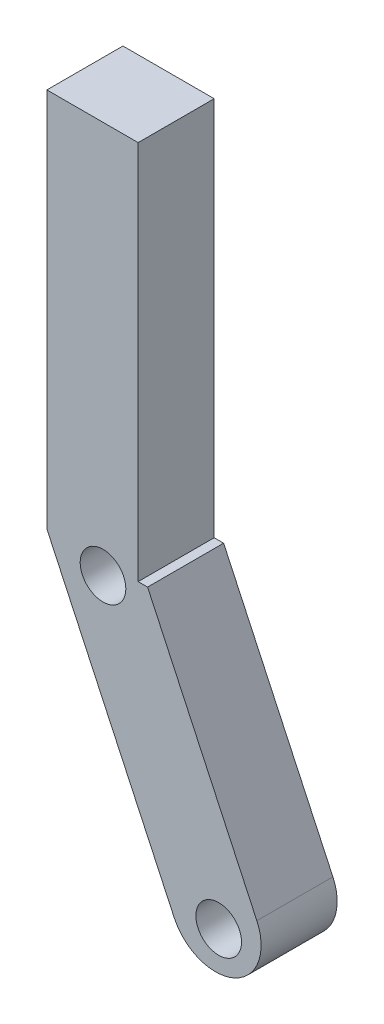
ISO-10303-21;
HEADER;
FILE_DESCRIPTION(('STEP AP214'),'2;1');
FILE_NAME('part.step','',(''),(''),'','','');
FILE_SCHEMA(('AUTOMOTIVE_DESIGN { 1 0 10303 214 1 1 1 1 }'));
ENDSEC;
DATA;
#1=APPLICATION_CONTEXT('core data for automotive mechanical design processes');
#2=APPLICATION_PROTOCOL_DEFINITION('international standard','automotive_design',2000,#1);
#3=PRODUCT_CONTEXT('',#1,'mechanical');
#4=PRODUCT('Part','Part','',(#3));
#5=PRODUCT_RELATED_PRODUCT_CATEGORY('part','',(#4));
#6=PRODUCT_DEFINITION_FORMATION('','',#4);
#7=PRODUCT_DEFINITION_CONTEXT('part definition',#1,'design');
#8=PRODUCT_DEFINITION('design','',#6,#7);
#9=PRODUCT_DEFINITION_SHAPE('','',#8);
#10=(LENGTH_UNIT() NAMED_UNIT(*) SI_UNIT(.MILLI.,.METRE.));
#11=(NAMED_UNIT(*) PLANE_ANGLE_UNIT() SI_UNIT($,.RADIAN.));
#12=(NAMED_UNIT(*) SI_UNIT($,.STERADIAN.) SOLID_ANGLE_UNIT());
#13=UNCERTAINTY_MEASURE_WITH_UNIT(LENGTH_MEASURE(1.E-05),#10,'distance_accuracy_value','');
#14=(GEOMETRIC_REPRESENTATION_CONTEXT(3) GLOBAL_UNCERTAINTY_ASSIGNED_CONTEXT((#13)) GLOBAL_UNIT_ASSIGNED_CONTEXT((#10,
#11,#12)) REPRESENTATION_CONTEXT('',''));
#15=CARTESIAN_POINT('',(0.,0.,0.));
#16=DIRECTION('',(0.,0.,1.));
#17=DIRECTION('',(1.,0.,0.));
#18=AXIS2_PLACEMENT_3D('',#15,#16,#17);
#19=CARTESIAN_POINT('',(11.0858546022568,-16.6750871648452,5.));
#20=DIRECTION('',(0.,0.,-1.));
#21=DIRECTION('',(-1.,0.,0.));
#22=AXIS2_PLACEMENT_3D('',#19,#20,#21);
#23=CYLINDRICAL_SURFACE('',#22,3.);
#24=DIRECTION('',(0.,0.,-1.));
#25=VECTOR('',#24,1.);
#26=CARTESIAN_POINT('',(13.8047779633667,-15.4072323796231,5.));
#27=LINE('',#26,#25);
#28=CARTESIAN_POINT('',(13.8047779633667,-15.4072323796231,5.));
#29=VERTEX_POINT('',#28);
#30=CARTESIAN_POINT('',(13.8047779633667,-15.4072323796231,0.));
#31=VERTEX_POINT('',#30);
#32=EDGE_CURVE('E110',#29,#31,#27,.T.);
#33=ORIENTED_EDGE('',*,*,#32,.F.);
#34=CARTESIAN_POINT('',(11.0858546022568,-16.6750871648452,5.));
#35=DIRECTION('',(0.,0.,1.));
#36=DIRECTION('',(1.,0.,0.));
#37=AXIS2_PLACEMENT_3D('',#34,#35,#36);
#38=CIRCLE('',#37,3.);
#39=CARTESIAN_POINT('',(8.36693124114681,-17.9429419500673,5.));
#40=VERTEX_POINT('',#39);
#41=EDGE_CURVE('E44',#40,#29,#38,.T.);
#42=ORIENTED_EDGE('',*,*,#41,.F.);
#43=DIRECTION('',(0.,0.,-1.));
#44=VECTOR('',#43,1.);
#45=CARTESIAN_POINT('',(8.36693124114681,-17.9429419500673,5.));
#46=LINE('',#45,#44);
#47=CARTESIAN_POINT('',(8.36693124114681,-17.9429419500673,0.));
#48=VERTEX_POINT('',#47);
#49=EDGE_CURVE('E149',#48,#40,#46,.F.);
#50=ORIENTED_EDGE('',*,*,#49,.F.);
#51=CARTESIAN_POINT('',(11.0858546022568,-16.6750871648452,0.));
#52=DIRECTION('',(0.,0.,1.));
#53=DIRECTION('',(1.,0.,0.));
#54=AXIS2_PLACEMENT_3D('',#51,#52,#53);
#55=CIRCLE('',#54,3.);
#56=EDGE_CURVE('E11',#31,#48,#55,.F.);
#57=ORIENTED_EDGE('',*,*,#56,.F.);
#58=EDGE_LOOP('',(#33,#42,#50,#57));
#59=FACE_BOUND('',#58,.T.);
#60=ADVANCED_FACE('F36',(#59),#23,.T.);
#61=CARTESIAN_POINT('',(0.,0.,5.));
#62=DIRECTION('',(0.,0.,1.));
#63=DIRECTION('',(1.,0.,0.));
#64=AXIS2_PLACEMENT_3D('',#61,#62,#63);
#65=PLANE('',#64);
#66=CARTESIAN_POINT('',(11.2971637331271,-17.1282410583635,5.));
#67=DIRECTION('',(0.,0.,1.));
#68=DIRECTION('',(1.,0.,0.));
#69=AXIS2_PLACEMENT_3D('',#66,#67,#68);
#70=CIRCLE('',#69,1.5);
#71=CARTESIAN_POINT('',(12.7971637331271,-17.1282410583635,5.));
#72=VERTEX_POINT('',#71);
#73=EDGE_CURVE('E129',#72,#72,#70,.T.);
#74=ORIENTED_EDGE('',*,*,#73,.F.);
#75=EDGE_LOOP('',(#74));
#76=FACE_BOUND('',#75,.T.);
#77=DIRECTION('',(0.422618261740694,-0.906307787036653,0.));
#78=VECTOR('',#77,1.);
#79=CARTESIAN_POINT('',(0.,0.,5.));
#80=LINE('',#79,#78);
#81=CARTESIAN_POINT('',(0.,0.,5.));
#82=VERTEX_POINT('',#81);
#83=EDGE_CURVE('E102',#82,#40,#80,.T.);
#84=ORIENTED_EDGE('',*,*,#83,.T.);
#85=ORIENTED_EDGE('',*,*,#41,.T.);
#86=DIRECTION('',(-0.422618261740694,0.906307787036652,0.));
#87=VECTOR('',#86,1.);
#88=CARTESIAN_POINT('',(15.0726327485888,-18.1261557407331,5.));
#89=LINE('',#88,#87);
#90=CARTESIAN_POINT('',(6.62026751377493,0.,5.));
#91=VERTEX_POINT('',#90);
#92=EDGE_CURVE('E92',#29,#91,#89,.T.);
#93=ORIENTED_EDGE('',*,*,#92,.T.);
#94=DIRECTION('',(-1.,0.,0.));
#95=VECTOR('',#94,1.);
#96=CARTESIAN_POINT('',(6.62026751377493,0.,5.));
#97=LINE('',#96,#95);
#98=CARTESIAN_POINT('',(6.,0.,5.));
#99=VERTEX_POINT('',#98);
#100=EDGE_CURVE('E98',#91,#99,#97,.T.);
#101=ORIENTED_EDGE('',*,*,#100,.T.);
#102=DIRECTION('',(0.,1.,0.));
#103=VECTOR('',#102,1.);
#104=CARTESIAN_POINT('',(6.,25.,5.));
#105=LINE('',#104,#103);
#106=CARTESIAN_POINT('',(6.,25.,5.));
#107=VERTEX_POINT('',#106);
#108=EDGE_CURVE('E116',#99,#107,#105,.T.);
#109=ORIENTED_EDGE('',*,*,#108,.T.);
#110=DIRECTION('',(-1.,0.,0.));
#111=VECTOR('',#110,1.);
#112=CARTESIAN_POINT('',(0.,25.,5.));
#113=LINE('',#112,#111);
#114=CARTESIAN_POINT('',(0.,25.,5.));
#115=VERTEX_POINT('',#114);
#116=EDGE_CURVE('E118',#107,#115,#113,.T.);
#117=ORIENTED_EDGE('',*,*,#116,.T.);
#118=DIRECTION('',(0.,-1.,0.));
#119=VECTOR('',#118,1.);
#120=CARTESIAN_POINT('',(0.,0.,5.));
#121=LINE('',#120,#119);
#122=EDGE_CURVE('E123',#115,#82,#121,.T.);
#123=ORIENTED_EDGE('',*,*,#122,.T.);
#124=EDGE_LOOP('',(#84,#85,#93,#101,#109,#117,#123));
#125=FACE_BOUND('',#124,.T.);
#126=CARTESIAN_POINT('',(3.69003502179463,-0.814700891703756,5.));
#127=DIRECTION('',(0.,0.,1.));
#128=DIRECTION('',(1.,0.,0.));
#129=AXIS2_PLACEMENT_3D('',#126,#127,#128);
#130=CIRCLE('',#129,1.5);
#131=CARTESIAN_POINT('',(5.19003502179463,-0.814700891703756,5.));
#132=VERTEX_POINT('',#131);
#133=EDGE_CURVE('E159',#132,#132,#130,.T.);
#134=ORIENTED_EDGE('',*,*,#133,.F.);
#135=EDGE_LOOP('',(#134));
#136=FACE_BOUND('',#135,.T.);
#137=ADVANCED_FACE('F95',(#76,#125,#136),#65,.T.);
#138=CARTESIAN_POINT('',(0.,0.,0.));
#139=DIRECTION('',(0.,0.,1.));
#140=DIRECTION('',(1.,0.,0.));
#141=AXIS2_PLACEMENT_3D('',#138,#139,#140);
#142=PLANE('',#141);
#143=DIRECTION('',(-0.422618261740694,0.906307787036652,0.));
#144=VECTOR('',#143,1.);
#145=CARTESIAN_POINT('',(15.0726327485888,-18.1261557407331,0.));
#146=LINE('',#145,#144);
#147=CARTESIAN_POINT('',(6.62026751377493,0.,0.));
#148=VERTEX_POINT('',#147);
#149=EDGE_CURVE('E107',#31,#148,#146,.T.);
#150=ORIENTED_EDGE('',*,*,#149,.F.);
#151=ORIENTED_EDGE('',*,*,#56,.T.);
#152=DIRECTION('',(0.422618261740694,-0.906307787036653,0.));
#153=VECTOR('',#152,1.);
#154=CARTESIAN_POINT('',(0.,0.,0.));
#155=LINE('',#154,#153);
#156=CARTESIAN_POINT('',(0.,0.,0.));
#157=VERTEX_POINT('',#156);
#158=EDGE_CURVE('E126',#157,#48,#155,.T.);
#159=ORIENTED_EDGE('',*,*,#158,.F.);
#160=DIRECTION('',(0.,-1.,0.));
#161=VECTOR('',#160,1.);
#162=CARTESIAN_POINT('',(0.,0.,0.));
#163=LINE('',#162,#161);
#164=CARTESIAN_POINT('',(0.,25.,0.));
#165=VERTEX_POINT('',#164);
#166=EDGE_CURVE('E137',#165,#157,#163,.T.);
#167=ORIENTED_EDGE('',*,*,#166,.F.);
#168=DIRECTION('',(-1.,0.,0.));
#169=VECTOR('',#168,1.);
#170=CARTESIAN_POINT('',(0.,25.,0.));
#171=LINE('',#170,#169);
#172=CARTESIAN_POINT('',(6.,25.,0.));
#173=VERTEX_POINT('',#172);
#174=EDGE_CURVE('E135',#173,#165,#171,.T.);
#175=ORIENTED_EDGE('',*,*,#174,.F.);
#176=DIRECTION('',(0.,1.,0.));
#177=VECTOR('',#176,1.);
#178=CARTESIAN_POINT('',(6.,25.,0.));
#179=LINE('',#178,#177);
#180=CARTESIAN_POINT('',(6.,0.,0.));
#181=VERTEX_POINT('',#180);
#182=EDGE_CURVE('E133',#181,#173,#179,.T.);
#183=ORIENTED_EDGE('',*,*,#182,.F.);
#184=DIRECTION('',(-1.,0.,0.));
#185=VECTOR('',#184,1.);
#186=CARTESIAN_POINT('',(6.62026751377493,0.,0.));
#187=LINE('',#186,#185);
#188=EDGE_CURVE('E131',#148,#181,#187,.T.);
#189=ORIENTED_EDGE('',*,*,#188,.F.);
#190=EDGE_LOOP('',(#150,#151,#159,#167,#175,#183,#189));
#191=FACE_BOUND('',#190,.T.);
#192=CARTESIAN_POINT('',(11.2971637331271,-17.1282410583635,0.));
#193=DIRECTION('',(0.,0.,1.));
#194=DIRECTION('',(1.,0.,0.));
#195=AXIS2_PLACEMENT_3D('',#192,#193,#194);
#196=CIRCLE('',#195,1.5);
#197=CARTESIAN_POINT('',(12.7971637331271,-17.1282410583635,0.));
#198=VERTEX_POINT('',#197);
#199=EDGE_CURVE('E156',#198,#198,#196,.T.);
#200=ORIENTED_EDGE('',*,*,#199,.T.);
#201=EDGE_LOOP('',(#200));
#202=FACE_BOUND('',#201,.T.);
#203=CARTESIAN_POINT('',(3.69003502179463,-0.814700891703756,0.));
#204=DIRECTION('',(0.,0.,1.));
#205=DIRECTION('',(1.,0.,0.));
#206=AXIS2_PLACEMENT_3D('',#203,#204,#205);
#207=CIRCLE('',#206,1.5);
#208=CARTESIAN_POINT('',(5.19003502179463,-0.814700891703756,0.));
#209=VERTEX_POINT('',#208);
#210=EDGE_CURVE('E162',#209,#209,#207,.T.);
#211=ORIENTED_EDGE('',*,*,#210,.T.);
#212=EDGE_LOOP('',(#211));
#213=FACE_BOUND('',#212,.T.);
#214=ADVANCED_FACE('F171',(#191,#202,#213),#142,.F.);
#215=CARTESIAN_POINT('',(0.,0.,5.));
#216=DIRECTION('',(0.906307787036653,0.422618261740694,0.));
#217=DIRECTION('',(-0.422618261740694,0.906307787036653,0.));
#218=AXIS2_PLACEMENT_3D('',#215,#216,#217);
#219=PLANE('',#218);
#220=ORIENTED_EDGE('',*,*,#158,.T.);
#221=ORIENTED_EDGE('',*,*,#49,.T.);
#222=ORIENTED_EDGE('',*,*,#83,.F.);
#223=DIRECTION('',(0.,0.,-1.));
#224=VECTOR('',#223,1.);
#225=CARTESIAN_POINT('',(0.,0.,5.));
#226=LINE('',#225,#224);
#227=EDGE_CURVE('E125',#82,#157,#226,.T.);
#228=ORIENTED_EDGE('',*,*,#227,.T.);
#229=EDGE_LOOP('',(#220,#221,#222,#228));
#230=FACE_BOUND('',#229,.T.);
#231=ADVANCED_FACE('F152',(#230),#219,.F.);
#232=CARTESIAN_POINT('',(15.0726327485888,-18.1261557407331,5.));
#233=DIRECTION('',(-0.906307787036653,-0.422618261740694,0.));
#234=DIRECTION('',(0.422618261740694,-0.906307787036653,0.));
#235=AXIS2_PLACEMENT_3D('',#232,#233,#234);
#236=PLANE('',#235);
#237=ORIENTED_EDGE('',*,*,#92,.F.);
#238=ORIENTED_EDGE('',*,*,#32,.T.);
#239=ORIENTED_EDGE('',*,*,#149,.T.);
#240=DIRECTION('',(0.,0.,-1.));
#241=VECTOR('',#240,1.);
#242=CARTESIAN_POINT('',(6.62026751377493,0.,5.));
#243=LINE('',#242,#241);
#244=EDGE_CURVE('E105',#91,#148,#243,.T.);
#245=ORIENTED_EDGE('',*,*,#244,.F.);
#246=EDGE_LOOP('',(#237,#238,#239,#245));
#247=FACE_BOUND('',#246,.T.);
#248=ADVANCED_FACE('F106',(#247),#236,.F.);
#249=CARTESIAN_POINT('',(6.62026751377493,0.,5.));
#250=DIRECTION('',(0.,-1.,0.));
#251=DIRECTION('',(1.,0.,0.));
#252=AXIS2_PLACEMENT_3D('',#249,#250,#251);
#253=PLANE('',#252);
#254=ORIENTED_EDGE('',*,*,#188,.T.);
#255=DIRECTION('',(0.,0.,-1.));
#256=VECTOR('',#255,1.);
#257=CARTESIAN_POINT('',(6.,0.,5.));
#258=LINE('',#257,#256);
#259=EDGE_CURVE('E111',#99,#181,#258,.T.);
#260=ORIENTED_EDGE('',*,*,#259,.F.);
#261=ORIENTED_EDGE('',*,*,#100,.F.);
#262=ORIENTED_EDGE('',*,*,#244,.T.);
#263=EDGE_LOOP('',(#254,#260,#261,#262));
#264=FACE_BOUND('',#263,.T.);
#265=ADVANCED_FACE('F113',(#264),#253,.F.);
#266=CARTESIAN_POINT('',(6.,25.,5.));
#267=DIRECTION('',(-1.,0.,0.));
#268=DIRECTION('',(0.,-1.,0.));
#269=AXIS2_PLACEMENT_3D('',#266,#267,#268);
#270=PLANE('',#269);
#271=ORIENTED_EDGE('',*,*,#182,.T.);
#272=DIRECTION('',(0.,0.,-1.));
#273=VECTOR('',#272,1.);
#274=CARTESIAN_POINT('',(6.,25.,5.));
#275=LINE('',#274,#273);
#276=EDGE_CURVE('E144',#107,#173,#275,.T.);
#277=ORIENTED_EDGE('',*,*,#276,.F.);
#278=ORIENTED_EDGE('',*,*,#108,.F.);
#279=ORIENTED_EDGE('',*,*,#259,.T.);
#280=EDGE_LOOP('',(#271,#277,#278,#279));
#281=FACE_BOUND('',#280,.T.);
#282=ADVANCED_FACE('F191',(#281),#270,.F.);
#283=CARTESIAN_POINT('',(0.,25.,5.));
#284=DIRECTION('',(0.,-1.,0.));
#285=DIRECTION('',(0.,0.,-1.));
#286=AXIS2_PLACEMENT_3D('',#283,#284,#285);
#287=PLANE('',#286);
#288=ORIENTED_EDGE('',*,*,#174,.T.);
#289=DIRECTION('',(0.,0.,-1.));
#290=VECTOR('',#289,1.);
#291=CARTESIAN_POINT('',(0.,25.,5.));
#292=LINE('',#291,#290);
#293=EDGE_CURVE('E141',#115,#165,#292,.T.);
#294=ORIENTED_EDGE('',*,*,#293,.F.);
#295=ORIENTED_EDGE('',*,*,#116,.F.);
#296=ORIENTED_EDGE('',*,*,#276,.T.);
#297=EDGE_LOOP('',(#288,#294,#295,#296));
#298=FACE_BOUND('',#297,.T.);
#299=ADVANCED_FACE('F187',(#298),#287,.F.);
#300=CARTESIAN_POINT('',(0.,0.,5.));
#301=DIRECTION('',(1.,0.,0.));
#302=DIRECTION('',(0.,0.,-1.));
#303=AXIS2_PLACEMENT_3D('',#300,#301,#302);
#304=PLANE('',#303);
#305=ORIENTED_EDGE('',*,*,#166,.T.);
#306=ORIENTED_EDGE('',*,*,#227,.F.);
#307=ORIENTED_EDGE('',*,*,#122,.F.);
#308=ORIENTED_EDGE('',*,*,#293,.T.);
#309=EDGE_LOOP('',(#305,#306,#307,#308));
#310=FACE_BOUND('',#309,.T.);
#311=ADVANCED_FACE('F184',(#310),#304,.F.);
#312=CARTESIAN_POINT('',(11.2971637331271,-17.1282410583635,5.));
#313=DIRECTION('',(0.,0.,-1.));
#314=DIRECTION('',(-1.,0.,0.));
#315=AXIS2_PLACEMENT_3D('',#312,#313,#314);
#316=CYLINDRICAL_SURFACE('',#315,1.5);
#317=ORIENTED_EDGE('',*,*,#73,.T.);
#318=EDGE_LOOP('',(#317));
#319=FACE_BOUND('',#318,.T.);
#320=ORIENTED_EDGE('',*,*,#199,.F.);
#321=EDGE_LOOP('',(#320));
#322=FACE_BOUND('',#321,.T.);
#323=ADVANCED_FACE('F181',(#319,#322),#316,.F.);
#324=CARTESIAN_POINT('',(3.69003502179463,-0.814700891703756,5.));
#325=DIRECTION('',(0.,0.,-1.));
#326=DIRECTION('',(-1.,0.,0.));
#327=AXIS2_PLACEMENT_3D('',#324,#325,#326);
#328=CYLINDRICAL_SURFACE('',#327,1.5);
#329=ORIENTED_EDGE('',*,*,#133,.T.);
#330=EDGE_LOOP('',(#329));
#331=FACE_BOUND('',#330,.T.);
#332=ORIENTED_EDGE('',*,*,#210,.F.);
#333=EDGE_LOOP('',(#332));
#334=FACE_BOUND('',#333,.T.);
#335=ADVANCED_FACE('F168',(#331,#334),#328,.F.);
#336=CLOSED_SHELL('',(#60,#137,#214,#231,#248,#265,#282,#299,#311,#323,#335));
#337=MANIFOLD_SOLID_BREP('B2',#336);
#338=ADVANCED_BREP_SHAPE_REPRESENTATION('',(#18,#337),#14);
#339=SHAPE_DEFINITION_REPRESENTATION(#9,#338);
ENDSEC;
END-ISO-10303-21;
